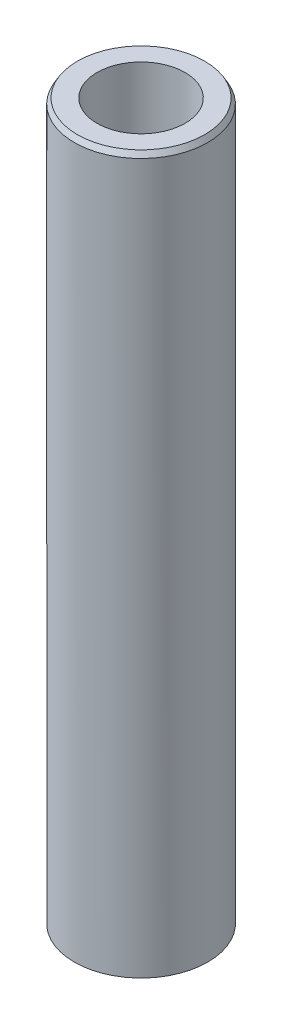
ISO-10303-21;
HEADER;
FILE_DESCRIPTION(('STEP AP214'),'2;1');
FILE_NAME('part.step','',(''),(''),'','','');
FILE_SCHEMA(('AUTOMOTIVE_DESIGN { 1 0 10303 214 1 1 1 1 }'));
ENDSEC;
DATA;
#1=APPLICATION_CONTEXT('core data for automotive mechanical design processes');
#2=APPLICATION_PROTOCOL_DEFINITION('international standard','automotive_design',2000,#1);
#3=PRODUCT_CONTEXT('',#1,'mechanical');
#4=PRODUCT('Part','Part','',(#3));
#5=PRODUCT_RELATED_PRODUCT_CATEGORY('part','',(#4));
#6=PRODUCT_DEFINITION_FORMATION('','',#4);
#7=PRODUCT_DEFINITION_CONTEXT('part definition',#1,'design');
#8=PRODUCT_DEFINITION('design','',#6,#7);
#9=PRODUCT_DEFINITION_SHAPE('','',#8);
#10=(LENGTH_UNIT() NAMED_UNIT(*) SI_UNIT(.MILLI.,.METRE.));
#11=(NAMED_UNIT(*) PLANE_ANGLE_UNIT() SI_UNIT($,.RADIAN.));
#12=(NAMED_UNIT(*) SI_UNIT($,.STERADIAN.) SOLID_ANGLE_UNIT());
#13=UNCERTAINTY_MEASURE_WITH_UNIT(LENGTH_MEASURE(1.E-05),#10,'distance_accuracy_value','');
#14=(GEOMETRIC_REPRESENTATION_CONTEXT(3) GLOBAL_UNCERTAINTY_ASSIGNED_CONTEXT((#13)) GLOBAL_UNIT_ASSIGNED_CONTEXT((#10,
#11,#12)) REPRESENTATION_CONTEXT('',''));
#15=CARTESIAN_POINT('',(0.,0.,0.));
#16=DIRECTION('',(0.,0.,1.));
#17=DIRECTION('',(1.,0.,0.));
#18=AXIS2_PLACEMENT_3D('',#15,#16,#17);
#19=CARTESIAN_POINT('',(0.,430.382745590446,0.));
#20=DIRECTION('',(0.,-1.,0.));
#21=DIRECTION('',(0.,0.,-1.));
#22=AXIS2_PLACEMENT_3D('',#19,#20,#21);
#23=CYLINDRICAL_SURFACE('',#22,40.);
#24=CARTESIAN_POINT('',(0.,427.197138617363,0.));
#25=DIRECTION('',(0.,1.,0.));
#26=DIRECTION('',(0.,0.,1.));
#27=AXIS2_PLACEMENT_3D('',#24,#25,#26);
#28=CIRCLE('',#27,40.);
#29=CARTESIAN_POINT('',(0.,427.197138617363,-40.));
#30=VERTEX_POINT('',#29);
#31=EDGE_CURVE('E50',#30,#30,#28,.F.);
#32=CARTESIAN_POINT('',(0.,1.83921104344198,0.));
#33=DIRECTION('',(0.,1.,0.));
#34=DIRECTION('',(0.,0.,1.));
#35=AXIS2_PLACEMENT_3D('',#32,#33,#34);
#36=CIRCLE('',#35,40.);
#37=CARTESIAN_POINT('',(0.,1.83921104344192,-40.));
#38=VERTEX_POINT('',#37);
#39=EDGE_CURVE('E51',#38,#38,#36,.T.);
#40=CARTESIAN_POINT('',(0.,427.197138617363,-40.));
#41=CARTESIAN_POINT('',(0.,422.766326871801,-40.));
#42=CARTESIAN_POINT('',(0.,418.33551512624,-40.));
#43=CARTESIAN_POINT('',(0.,409.473891635116,-40.));
#44=CARTESIAN_POINT('',(0.,405.043079889555,-40.));
#45=CARTESIAN_POINT('',(0.,396.181456398431,-40.));
#46=CARTESIAN_POINT('',(0.,391.750644652869,-40.));
#47=CARTESIAN_POINT('',(0.,382.889021161746,-40.));
#48=CARTESIAN_POINT('',(0.,378.458209416184,-40.));
#49=CARTESIAN_POINT('',(0.,369.596585925061,-40.));
#50=CARTESIAN_POINT('',(0.,365.165774179499,-40.));
#51=CARTESIAN_POINT('',(0.,356.304150688376,-40.));
#52=CARTESIAN_POINT('',(0.,351.873338942814,-40.));
#53=CARTESIAN_POINT('',(0.,343.011715451691,-40.));
#54=CARTESIAN_POINT('',(0.,338.580903706129,-40.));
#55=CARTESIAN_POINT('',(0.,329.719280215006,-40.));
#56=CARTESIAN_POINT('',(0.,325.288468469444,-40.));
#57=CARTESIAN_POINT('',(0.,316.426844978321,-40.));
#58=CARTESIAN_POINT('',(0.,311.996033232759,-40.));
#59=CARTESIAN_POINT('',(0.,303.134409741636,-40.));
#60=CARTESIAN_POINT('',(0.,298.703597996074,-40.));
#61=CARTESIAN_POINT('',(0.,289.841974504951,-40.));
#62=CARTESIAN_POINT('',(0.,285.411162759389,-40.));
#63=CARTESIAN_POINT('',(0.,276.549539268266,-40.));
#64=CARTESIAN_POINT('',(0.,272.118727522704,-40.));
#65=CARTESIAN_POINT('',(0.,263.257104031581,-40.));
#66=CARTESIAN_POINT('',(0.,258.826292286019,-40.));
#67=CARTESIAN_POINT('',(0.,249.964668794896,-40.));
#68=CARTESIAN_POINT('',(0.,245.533857049334,-40.));
#69=CARTESIAN_POINT('',(0.,236.672233558211,-40.));
#70=CARTESIAN_POINT('',(0.,232.241421812649,-40.));
#71=CARTESIAN_POINT('',(0.,223.379798321526,-40.));
#72=CARTESIAN_POINT('',(0.,218.948986575964,-40.));
#73=CARTESIAN_POINT('',(0.,210.087363084841,-40.));
#74=CARTESIAN_POINT('',(0.,205.656551339279,-40.));
#75=CARTESIAN_POINT('',(0.,196.794927848156,-40.));
#76=CARTESIAN_POINT('',(0.,192.364116102594,-40.));
#77=CARTESIAN_POINT('',(0.,183.502492611471,-40.));
#78=CARTESIAN_POINT('',(0.,179.071680865909,-40.));
#79=CARTESIAN_POINT('',(0.,170.210057374786,-40.));
#80=CARTESIAN_POINT('',(0.,165.779245629224,-40.));
#81=CARTESIAN_POINT('',(0.,156.917622138101,-40.));
#82=CARTESIAN_POINT('',(0.,152.486810392539,-40.));
#83=CARTESIAN_POINT('',(0.,143.625186901416,-40.));
#84=CARTESIAN_POINT('',(0.,139.194375155854,-40.));
#85=CARTESIAN_POINT('',(0.,130.332751664731,-40.));
#86=CARTESIAN_POINT('',(0.,125.901939919169,-40.));
#87=CARTESIAN_POINT('',(0.,117.040316428046,-40.));
#88=CARTESIAN_POINT('',(0.,112.609504682484,-40.));
#89=CARTESIAN_POINT('',(0.,103.747881191361,-40.));
#90=CARTESIAN_POINT('',(0.,99.3170694457988,-40.));
#91=CARTESIAN_POINT('',(0.,90.4554459546755,-40.));
#92=CARTESIAN_POINT('',(0.,86.0246342091138,-40.));
#93=CARTESIAN_POINT('',(0.,77.1630107179905,-40.));
#94=CARTESIAN_POINT('',(0.,72.7321989724288,-40.));
#95=CARTESIAN_POINT('',(0.,63.8705754813054,-40.));
#96=CARTESIAN_POINT('',(0.,59.4397637357437,-40.));
#97=CARTESIAN_POINT('',(0.,50.5781402446204,-40.));
#98=CARTESIAN_POINT('',(0.,46.1473284990587,-40.));
#99=CARTESIAN_POINT('',(0.,37.2857050079354,-40.));
#100=CARTESIAN_POINT('',(0.,32.8548932623737,-40.));
#101=CARTESIAN_POINT('',(0.,23.9932697712504,-40.));
#102=CARTESIAN_POINT('',(0.,19.5624580256887,-40.));
#103=CARTESIAN_POINT('',(0.,10.7008345345653,-40.));
#104=CARTESIAN_POINT('',(0.,6.27002278900363,-40.));
#105=CARTESIAN_POINT('',(0.,1.83921104344192,-40.));
#106=B_SPLINE_CURVE_WITH_KNOTS('',3,(#40,#41,#42,#43,#44,#45,#46,#47,#48,#49,#50,#51,#52,#53,
#54,#55,#56,#57,#58,#59,#60,#61,#62,#63,#64,#65,#66,#67,#68,#69,#70,#71,#72,#73,#74,#75,#76,#77,
#78,#79,#80,#81,#82,#83,#84,#85,#86,#87,#88,#89,#90,#91,#92,#93,#94,#95,#96,#97,#98,#99,#100,
#101,#102,#103,#104,#105),.UNSPECIFIED.,.F.,.F.,(4,2,2,2,2,2,2,2,2,2,2,2,2,2,2,2,2,2,2,2,2,2,2,
2,2,2,2,2,2,2,2,2,4),(0.,13.2924352366851,26.5848704733701,39.8773057100551,53.1697409467401,
66.4621761834251,79.7546114201102,93.0470466567952,106.33948189348,119.631917130165,
132.92435236685,146.216787603535,159.50922284022,172.801658076905,186.09409331359,
199.386528550275,212.678963786961,225.971399023646,239.263834260331,252.556269497016,
265.848704733701,279.141139970386,292.433575207071,305.726010443756,319.018445680441,
332.310880917126,345.603316153811,358.895751390496,372.188186627181,385.480621863866,
398.773057100551,412.065492337236,425.357927573921),.UNSPECIFIED.);
#107=EDGE_CURVE('BSEAM39',#30,#38,#106,.T.);
#108=ORIENTED_EDGE('',*,*,#31,.T.);
#109=ORIENTED_EDGE('',*,*,#39,.T.);
#110=ORIENTED_EDGE('',*,*,#107,.T.);
#111=ORIENTED_EDGE('',*,*,#107,.F.);
#112=EDGE_LOOP('',(#108,#110,#109,#111));
#113=FACE_BOUND('',#112,.T.);
#114=ADVANCED_FACE('F39',(#113),#23,.T.);
#115=CARTESIAN_POINT('',(0.,430.382745590446,0.));
#116=DIRECTION('',(0.,1.,0.));
#117=DIRECTION('',(0.,0.,1.));
#118=AXIS2_PLACEMENT_3D('',#115,#116,#117);
#119=PLANE('',#118);
#120=CARTESIAN_POINT('',(0.,430.382745590446,0.));
#121=DIRECTION('',(0.,1.,0.));
#122=DIRECTION('',(0.,0.,1.));
#123=AXIS2_PLACEMENT_3D('',#120,#121,#122);
#124=CIRCLE('',#123,38.1607889565584);
#125=CARTESIAN_POINT('',(0.,430.382745590446,38.1607889565584));
#126=VERTEX_POINT('',#125);
#127=EDGE_CURVE('E54',#126,#126,#124,.T.);
#128=ORIENTED_EDGE('',*,*,#127,.T.);
#129=EDGE_LOOP('',(#128));
#130=FACE_BOUND('',#129,.T.);
#131=CARTESIAN_POINT('',(0.,430.382745590446,0.));
#132=DIRECTION('',(0.,1.,0.));
#133=DIRECTION('',(0.,0.,1.));
#134=AXIS2_PLACEMENT_3D('',#131,#132,#133);
#135=CIRCLE('',#134,26.3971055335164);
#136=CARTESIAN_POINT('',(0.,430.382745590446,-26.3971055335164));
#137=VERTEX_POINT('',#136);
#138=EDGE_CURVE('E58',#137,#137,#135,.T.);
#139=ORIENTED_EDGE('',*,*,#138,.F.);
#140=EDGE_LOOP('',(#139));
#141=FACE_BOUND('',#140,.T.);
#142=ADVANCED_FACE('F69',(#130,#141),#119,.T.);
#143=CARTESIAN_POINT('',(0.,0.,0.));
#144=DIRECTION('',(0.,1.,0.));
#145=DIRECTION('',(0.,0.,1.));
#146=AXIS2_PLACEMENT_3D('',#143,#144,#145);
#147=PLANE('',#146);
#148=CARTESIAN_POINT('',(0.,0.,0.));
#149=DIRECTION('',(0.,1.,0.));
#150=DIRECTION('',(0.,0.,1.));
#151=AXIS2_PLACEMENT_3D('',#148,#149,#150);
#152=CIRCLE('',#151,36.8143930269167);
#153=CARTESIAN_POINT('',(0.,0.,36.8143930269167));
#154=VERTEX_POINT('',#153);
#155=EDGE_CURVE('E10',#154,#154,#152,.F.);
#156=ORIENTED_EDGE('',*,*,#155,.T.);
#157=EDGE_LOOP('',(#156));
#158=FACE_BOUND('',#157,.T.);
#159=CARTESIAN_POINT('',(0.,0.,0.));
#160=DIRECTION('',(0.,1.,0.));
#161=DIRECTION('',(0.,0.,1.));
#162=AXIS2_PLACEMENT_3D('',#159,#160,#161);
#163=CIRCLE('',#162,26.3971055335164);
#164=CARTESIAN_POINT('',(0.,0.,-26.3971055335164));
#165=VERTEX_POINT('',#164);
#166=EDGE_CURVE('E63',#165,#165,#163,.T.);
#167=ORIENTED_EDGE('',*,*,#166,.T.);
#168=EDGE_LOOP('',(#167));
#169=FACE_BOUND('',#168,.T.);
#170=ADVANCED_FACE('F75',(#158,#169),#147,.F.);
#171=CARTESIAN_POINT('',(0.,430.382745590446,0.));
#172=DIRECTION('',(0.,-1.,0.));
#173=DIRECTION('',(0.,0.,-1.));
#174=AXIS2_PLACEMENT_3D('',#171,#172,#173);
#175=CYLINDRICAL_SURFACE('',#174,26.3971055335164);
#176=CARTESIAN_POINT('',(0.,430.382745590446,-26.3971055335164));
#177=CARTESIAN_POINT('',(0.,425.899591990545,-26.3971055335164));
#178=CARTESIAN_POINT('',(0.,421.416438390645,-26.3971055335164));
#179=CARTESIAN_POINT('',(0.,412.450131190844,-26.3971055335164));
#180=CARTESIAN_POINT('',(0.,407.966977590943,-26.3971055335164));
#181=CARTESIAN_POINT('',(0.,399.000670391142,-26.3971055335164));
#182=CARTESIAN_POINT('',(0.,394.517516791242,-26.3971055335164));
#183=CARTESIAN_POINT('',(0.,385.551209591441,-26.3971055335164));
#184=CARTESIAN_POINT('',(0.,381.06805599154,-26.3971055335164));
#185=CARTESIAN_POINT('',(0.,372.101748791739,-26.3971055335164));
#186=CARTESIAN_POINT('',(0.,367.618595191839,-26.3971055335164));
#187=CARTESIAN_POINT('',(0.,358.652287992038,-26.3971055335164));
#188=CARTESIAN_POINT('',(0.,354.169134392137,-26.3971055335164));
#189=CARTESIAN_POINT('',(0.,345.202827192336,-26.3971055335164));
#190=CARTESIAN_POINT('',(0.,340.719673592436,-26.3971055335164));
#191=CARTESIAN_POINT('',(0.,331.753366392635,-26.3971055335164));
#192=CARTESIAN_POINT('',(0.,327.270212792735,-26.3971055335164));
#193=CARTESIAN_POINT('',(0.,318.303905592934,-26.3971055335164));
#194=CARTESIAN_POINT('',(0.,313.820751993033,-26.3971055335164));
#195=CARTESIAN_POINT('',(0.,304.854444793232,-26.3971055335164));
#196=CARTESIAN_POINT('',(0.,300.371291193332,-26.3971055335164));
#197=CARTESIAN_POINT('',(0.,291.404983993531,-26.3971055335164));
#198=CARTESIAN_POINT('',(0.,286.92183039363,-26.3971055335164));
#199=CARTESIAN_POINT('',(0.,277.955523193829,-26.3971055335164));
#200=CARTESIAN_POINT('',(0.,273.472369593929,-26.3971055335164));
#201=CARTESIAN_POINT('',(0.,264.506062394128,-26.3971055335164));
#202=CARTESIAN_POINT('',(0.,260.022908794227,-26.3971055335164));
#203=CARTESIAN_POINT('',(0.,251.056601594426,-26.3971055335164));
#204=CARTESIAN_POINT('',(0.,246.573447994526,-26.3971055335164));
#205=CARTESIAN_POINT('',(0.,237.607140794725,-26.3971055335164));
#206=CARTESIAN_POINT('',(0.,233.123987194825,-26.3971055335164));
#207=CARTESIAN_POINT('',(0.,224.157679995024,-26.3971055335164));
#208=CARTESIAN_POINT('',(0.,219.674526395123,-26.3971055335164));
#209=CARTESIAN_POINT('',(0.,210.708219195322,-26.3971055335164));
#210=CARTESIAN_POINT('',(0.,206.225065595422,-26.3971055335164));
#211=CARTESIAN_POINT('',(0.,197.258758395621,-26.3971055335164));
#212=CARTESIAN_POINT('',(0.,192.77560479572,-26.3971055335164));
#213=CARTESIAN_POINT('',(0.,183.809297595919,-26.3971055335164));
#214=CARTESIAN_POINT('',(0.,179.326143996019,-26.3971055335164));
#215=CARTESIAN_POINT('',(0.,170.359836796218,-26.3971055335164));
#216=CARTESIAN_POINT('',(0.,165.876683196318,-26.3971055335164));
#217=CARTESIAN_POINT('',(0.,156.910375996517,-26.3971055335164));
#218=CARTESIAN_POINT('',(0.,152.427222396616,-26.3971055335164));
#219=CARTESIAN_POINT('',(0.,143.460915196815,-26.3971055335164));
#220=CARTESIAN_POINT('',(0.,138.977761596915,-26.3971055335164));
#221=CARTESIAN_POINT('',(0.,130.011454397114,-26.3971055335164));
#222=CARTESIAN_POINT('',(0.,125.528300797213,-26.3971055335164));
#223=CARTESIAN_POINT('',(0.,116.561993597412,-26.3971055335164));
#224=CARTESIAN_POINT('',(0.,112.078839997512,-26.3971055335164));
#225=CARTESIAN_POINT('',(0.,103.112532797711,-26.3971055335164));
#226=CARTESIAN_POINT('',(0.,98.6293791978104,-26.3971055335164));
#227=CARTESIAN_POINT('',(0.,89.6630719980094,-26.3971055335164));
#228=CARTESIAN_POINT('',(0.,85.179918398109,-26.3971055335164));
#229=CARTESIAN_POINT('',(0.,76.213611198308,-26.3971055335164));
#230=CARTESIAN_POINT('',(0.,71.7304575984076,-26.3971055335164));
#231=CARTESIAN_POINT('',(0.,62.7641503986066,-26.3971055335164));
#232=CARTESIAN_POINT('',(0.,58.2809967987061,-26.3971055335164));
#233=CARTESIAN_POINT('',(0.,49.3146895989052,-26.3971055335164));
#234=CARTESIAN_POINT('',(0.,44.8315359990047,-26.3971055335164));
#235=CARTESIAN_POINT('',(0.,35.8652287992037,-26.3971055335164));
#236=CARTESIAN_POINT('',(0.,31.3820751993033,-26.3971055335164));
#237=CARTESIAN_POINT('',(0.,22.4157679995023,-26.3971055335164));
#238=CARTESIAN_POINT('',(0.,17.9326143996019,-26.3971055335164));
#239=CARTESIAN_POINT('',(0.,8.96630719980091,-26.3971055335164));
#240=CARTESIAN_POINT('',(0.,4.48315359990043,-26.3971055335164));
#241=CARTESIAN_POINT('',(0.,0.,-26.3971055335164));
#242=B_SPLINE_CURVE_WITH_KNOTS('',3,(#176,#177,#178,#179,#180,#181,#182,#183,#184,#185,#186,
#187,#188,#189,#190,#191,#192,#193,#194,#195,#196,#197,#198,#199,#200,#201,#202,#203,#204,#205,
#206,#207,#208,#209,#210,#211,#212,#213,#214,#215,#216,#217,#218,#219,#220,#221,#222,#223,#224,
#225,#226,#227,#228,#229,#230,#231,#232,#233,#234,#235,#236,#237,#238,#239,#240,#241),
.UNSPECIFIED.,.F.,.F.,(4,2,2,2,2,2,2,2,2,2,2,2,2,2,2,2,2,2,2,2,2,2,2,2,2,2,2,2,2,2,2,2,4),(0.,
13.4494607997014,26.8989215994029,40.3483823991043,53.7978431988057,67.2473039985071,
80.6967647982086,94.14622559791,107.595686397611,121.045147197313,134.494607997014,
147.944068796716,161.393529596417,174.842990396119,188.29245119582,201.741911995521,
215.191372795223,228.640833594924,242.090294394626,255.539755194327,268.989215994028,
282.43867679373,295.888137593431,309.337598393133,322.787059192834,336.236519992536,
349.685980792237,363.135441591938,376.58490239164,390.034363191341,403.483823991043,
416.933284790744,430.382745590446),.UNSPECIFIED.);
#243=EDGE_CURVE('BSEAM70',#137,#165,#242,.T.);
#244=ORIENTED_EDGE('',*,*,#138,.T.);
#245=ORIENTED_EDGE('',*,*,#166,.F.);
#246=ORIENTED_EDGE('',*,*,#243,.T.);
#247=ORIENTED_EDGE('',*,*,#243,.F.);
#248=EDGE_LOOP('',(#244,#246,#245,#247));
#249=FACE_BOUND('',#248,.T.);
#250=ADVANCED_FACE('F70',(#249),#175,.F.);
#251=CARTESIAN_POINT('',(0.,430.382745590446,0.));
#252=DIRECTION('',(0.,-1.,0.));
#253=DIRECTION('',(0.,0.,-1.));
#254=AXIS2_PLACEMENT_3D('',#251,#252,#253);
#255=CONICAL_SURFACE('',#254,38.1607889565584,0.52359877559829);
#256=ORIENTED_EDGE('',*,*,#31,.F.);
#257=EDGE_LOOP('',(#256));
#258=FACE_BOUND('',#257,.T.);
#259=ORIENTED_EDGE('',*,*,#127,.F.);
#260=EDGE_LOOP('',(#259));
#261=FACE_BOUND('',#260,.T.);
#262=ADVANCED_FACE('F81',(#258,#261),#255,.T.);
#263=CARTESIAN_POINT('',(0.,1.83921104344198,0.));
#264=DIRECTION('',(0.,1.,0.));
#265=DIRECTION('',(0.,0.,1.));
#266=AXIS2_PLACEMENT_3D('',#263,#264,#265);
#267=CONICAL_SURFACE('',#266,40.,1.0471975511966);
#268=ORIENTED_EDGE('',*,*,#155,.F.);
#269=EDGE_LOOP('',(#268));
#270=FACE_BOUND('',#269,.T.);
#271=ORIENTED_EDGE('',*,*,#39,.F.);
#272=EDGE_LOOP('',(#271));
#273=FACE_BOUND('',#272,.T.);
#274=ADVANCED_FACE('F45',(#270,#273),#267,.T.);
#275=CLOSED_SHELL('',(#114,#142,#170,#250,#262,#274));
#276=MANIFOLD_SOLID_BREP('B2',#275);
#277=ADVANCED_BREP_SHAPE_REPRESENTATION('',(#18,#276),#14);
#278=SHAPE_DEFINITION_REPRESENTATION(#9,#277);
ENDSEC;
END-ISO-10303-21;
